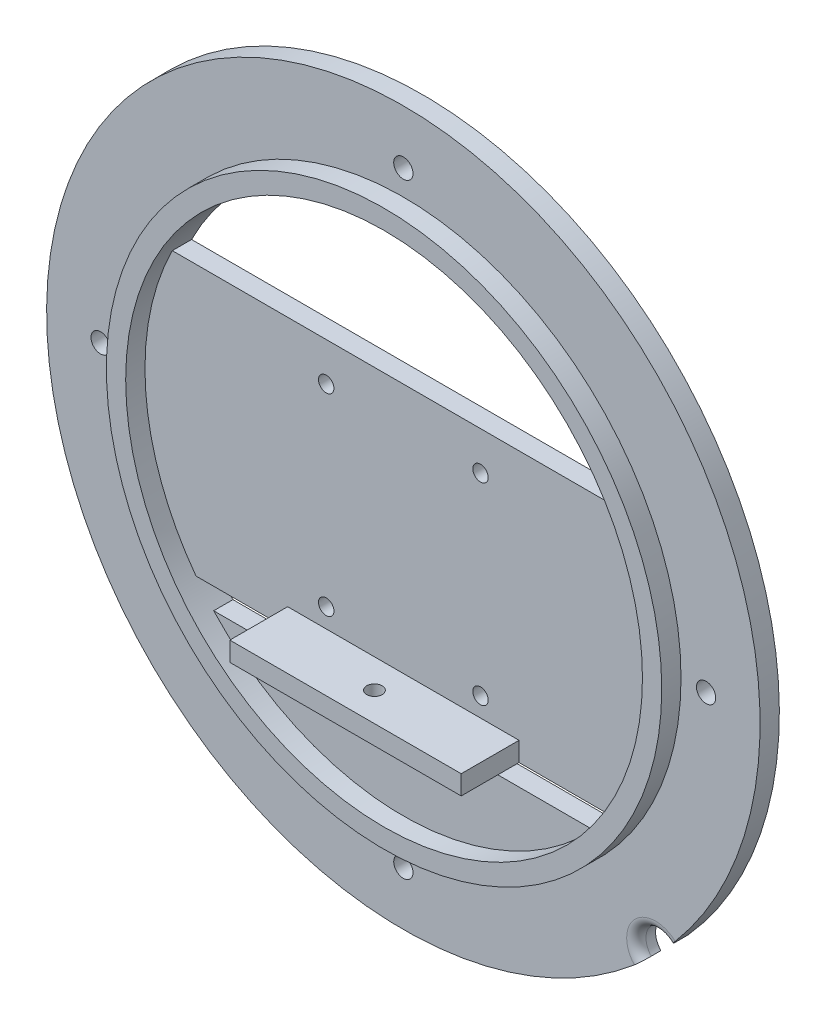
ISO-10303-21;
HEADER;
FILE_DESCRIPTION(('STEP AP214'),'2;1');
FILE_NAME('part.step','',(''),(''),'','','');
FILE_SCHEMA(('AUTOMOTIVE_DESIGN { 1 0 10303 214 1 1 1 1 }'));
ENDSEC;
DATA;
#1=APPLICATION_CONTEXT('core data for automotive mechanical design processes');
#2=APPLICATION_PROTOCOL_DEFINITION('international standard','automotive_design',2000,#1);
#3=PRODUCT_CONTEXT('',#1,'mechanical');
#4=PRODUCT('Part','Part','',(#3));
#5=PRODUCT_RELATED_PRODUCT_CATEGORY('part','',(#4));
#6=PRODUCT_DEFINITION_FORMATION('','',#4);
#7=PRODUCT_DEFINITION_CONTEXT('part definition',#1,'design');
#8=PRODUCT_DEFINITION('design','',#6,#7);
#9=PRODUCT_DEFINITION_SHAPE('','',#8);
#10=(LENGTH_UNIT() NAMED_UNIT(*) SI_UNIT(.MILLI.,.METRE.));
#11=(NAMED_UNIT(*) PLANE_ANGLE_UNIT() SI_UNIT($,.RADIAN.));
#12=(NAMED_UNIT(*) SI_UNIT($,.STERADIAN.) SOLID_ANGLE_UNIT());
#13=UNCERTAINTY_MEASURE_WITH_UNIT(LENGTH_MEASURE(1.E-05),#10,'distance_accuracy_value','');
#14=(GEOMETRIC_REPRESENTATION_CONTEXT(3) GLOBAL_UNCERTAINTY_ASSIGNED_CONTEXT((#13)) GLOBAL_UNIT_ASSIGNED_CONTEXT((#10,
#11,#12)) REPRESENTATION_CONTEXT('',''));
#15=CARTESIAN_POINT('',(0.,0.,0.));
#16=DIRECTION('',(0.,0.,1.));
#17=DIRECTION('',(1.,0.,0.));
#18=AXIS2_PLACEMENT_3D('',#15,#16,#17);
#19=CARTESIAN_POINT('',(0.,0.,5.));
#20=DIRECTION('',(0.,0.,1.));
#21=DIRECTION('',(1.,0.,0.));
#22=AXIS2_PLACEMENT_3D('',#19,#20,#21);
#23=PLANE('',#22);
#24=CARTESIAN_POINT('',(-20.,-30.,5.));
#25=DIRECTION('',(0.,0.,1.));
#26=DIRECTION('',(1.,0.,0.));
#27=AXIS2_PLACEMENT_3D('',#24,#25,#26);
#28=CIRCLE('',#27,2.);
#29=CARTESIAN_POINT('',(-18.,-30.,5.));
#30=VERTEX_POINT('',#29);
#31=EDGE_CURVE('E306',#30,#30,#28,.F.);
#32=ORIENTED_EDGE('',*,*,#31,.T.);
#33=EDGE_LOOP('',(#32));
#34=FACE_BOUND('',#33,.T.);
#35=CARTESIAN_POINT('',(-20.,20.,5.));
#36=DIRECTION('',(0.,0.,1.));
#37=DIRECTION('',(1.,0.,0.));
#38=AXIS2_PLACEMENT_3D('',#35,#36,#37);
#39=CIRCLE('',#38,2.00000000000001);
#40=CARTESIAN_POINT('',(-18.,20.,5.));
#41=VERTEX_POINT('',#40);
#42=EDGE_CURVE('E313',#41,#41,#39,.F.);
#43=ORIENTED_EDGE('',*,*,#42,.T.);
#44=EDGE_LOOP('',(#43));
#45=FACE_BOUND('',#44,.T.);
#46=CARTESIAN_POINT('',(20.,20.,5.));
#47=DIRECTION('',(0.,0.,1.));
#48=DIRECTION('',(1.,0.,0.));
#49=AXIS2_PLACEMENT_3D('',#46,#47,#48);
#50=CIRCLE('',#49,2.00000000000001);
#51=CARTESIAN_POINT('',(22.,20.,5.));
#52=VERTEX_POINT('',#51);
#53=EDGE_CURVE('E305',#52,#52,#50,.F.);
#54=ORIENTED_EDGE('',*,*,#53,.T.);
#55=EDGE_LOOP('',(#54));
#56=FACE_BOUND('',#55,.T.);
#57=CARTESIAN_POINT('',(20.,-30.,5.));
#58=DIRECTION('',(0.,0.,1.));
#59=DIRECTION('',(1.,0.,0.));
#60=AXIS2_PLACEMENT_3D('',#57,#58,#59);
#61=CIRCLE('',#60,2.);
#62=CARTESIAN_POINT('',(22.,-30.,5.));
#63=VERTEX_POINT('',#62);
#64=EDGE_CURVE('E298',#63,#63,#61,.F.);
#65=ORIENTED_EDGE('',*,*,#64,.T.);
#66=EDGE_LOOP('',(#65));
#67=FACE_BOUND('',#66,.T.);
#68=DIRECTION('',(-1.,0.,0.));
#69=VECTOR('',#68,1.);
#70=CARTESIAN_POINT('',(30.,-35.,5.));
#71=LINE('',#70,#69);
#72=CARTESIAN_POINT('',(30.,-35.,5.));
#73=VERTEX_POINT('',#72);
#74=CARTESIAN_POINT('',(-30.,-35.,5.));
#75=VERTEX_POINT('',#74);
#76=EDGE_CURVE('E360',#73,#75,#71,.T.);
#77=ORIENTED_EDGE('',*,*,#76,.F.);
#78=DIRECTION('',(0.,1.,0.));
#79=VECTOR('',#78,1.);
#80=CARTESIAN_POINT('',(30.,-40.,5.));
#81=LINE('',#80,#79);
#82=CARTESIAN_POINT('',(30.,-40.,5.));
#83=VERTEX_POINT('',#82);
#84=EDGE_CURVE('E362',#83,#73,#81,.T.);
#85=ORIENTED_EDGE('',*,*,#84,.F.);
#86=DIRECTION('',(-1.,0.,0.));
#87=VECTOR('',#86,1.);
#88=CARTESIAN_POINT('',(-70.,-40.,5.));
#89=LINE('',#88,#87);
#90=CARTESIAN_POINT('',(53.7494186015067,-40.,5.));
#91=VERTEX_POINT('',#90);
#92=EDGE_CURVE('E248',#91,#83,#89,.T.);
#93=ORIENTED_EDGE('',*,*,#92,.F.);
#94=CARTESIAN_POINT('',(0.,0.,5.));
#95=DIRECTION('',(0.,0.,1.));
#96=DIRECTION('',(1.,0.,0.));
#97=AXIS2_PLACEMENT_3D('',#94,#95,#96);
#98=CIRCLE('',#97,67.);
#99=CARTESIAN_POINT('',(59.9082632030007,30.,5.));
#100=VERTEX_POINT('',#99);
#101=EDGE_CURVE('E161',#100,#91,#98,.F.);
#102=ORIENTED_EDGE('',*,*,#101,.F.);
#103=DIRECTION('',(1.,0.,0.));
#104=VECTOR('',#103,1.);
#105=CARTESIAN_POINT('',(-70.,30.,5.));
#106=LINE('',#105,#104);
#107=CARTESIAN_POINT('',(-59.9082632030007,30.,5.));
#108=VERTEX_POINT('',#107);
#109=EDGE_CURVE('E289',#108,#100,#106,.T.);
#110=ORIENTED_EDGE('',*,*,#109,.F.);
#111=CARTESIAN_POINT('',(-53.7494186015068,-40.,5.));
#112=VERTEX_POINT('',#111);
#113=EDGE_CURVE('E164',#112,#108,#98,.F.);
#114=ORIENTED_EDGE('',*,*,#113,.F.);
#115=CARTESIAN_POINT('',(-30.,-40.,5.));
#116=VERTEX_POINT('',#115);
#117=EDGE_CURVE('E292',#116,#112,#89,.T.);
#118=ORIENTED_EDGE('',*,*,#117,.F.);
#119=DIRECTION('',(0.,-1.,0.));
#120=VECTOR('',#119,1.);
#121=CARTESIAN_POINT('',(-30.,-40.,5.));
#122=LINE('',#121,#120);
#123=EDGE_CURVE('E356',#75,#116,#122,.T.);
#124=ORIENTED_EDGE('',*,*,#123,.F.);
#125=EDGE_LOOP('',(#77,#85,#93,#102,#110,#114,#118,#124));
#126=FACE_BOUND('',#125,.T.);
#127=ADVANCED_FACE('F33',(#34,#45,#56,#67,#126),#23,.T.);
#128=CARTESIAN_POINT('',(0.,0.,5.));
#129=DIRECTION('',(0.,0.,-1.));
#130=DIRECTION('',(-1.,0.,0.));
#131=AXIS2_PLACEMENT_3D('',#128,#129,#130);
#132=CYLINDRICAL_SURFACE('',#131,92.5);
#133=DIRECTION('',(0.,0.,-1.));
#134=VECTOR('',#133,1.);
#135=CARTESIAN_POINT('',(61.7775799026703,-68.8460646759798,5.));
#136=LINE('',#135,#134);
#137=CARTESIAN_POINT('',(61.7775799026702,-68.8460646759798,0.));
#138=VERTEX_POINT('',#137);
#139=CARTESIAN_POINT('',(61.7775799026703,-68.8460646759798,2.5));
#140=VERTEX_POINT('',#139);
#141=EDGE_CURVE('E141',#138,#140,#136,.F.);
#142=ORIENTED_EDGE('',*,*,#141,.T.);
#143=CARTESIAN_POINT('',(61.7775799026703,-68.8460646759798,2.5));
#144=CARTESIAN_POINT('',(61.7775845242661,-68.8460597267927,2.57029488064408));
#145=CARTESIAN_POINT('',(61.7753724411692,-68.8480454745653,2.64058656436094));
#146=CARTESIAN_POINT('',(61.7665508133537,-68.8559602717512,2.7806669257484));
#147=CARTESIAN_POINT('',(61.7599414812899,-68.8618891304723,2.85045562757868));
#148=CARTESIAN_POINT('',(61.742367995557,-68.8776460578529,2.98898750084374));
#149=CARTESIAN_POINT('',(61.7314071644362,-68.8874711515706,3.05773142852272));
#150=CARTESIAN_POINT('',(61.7052139606343,-68.9109343734118,3.19371814053275));
#151=CARTESIAN_POINT('',(61.6899816398252,-68.9245724552311,3.26096094308244));
#152=CARTESIAN_POINT('',(61.6379899597252,-68.9710837400947,3.4597886614452));
#153=CARTESIAN_POINT('',(61.5949286722283,-69.0095604698082,3.58852951132559));
#154=CARTESIAN_POINT('',(61.4932139902941,-69.1002115822862,3.83439581930428));
#155=CARTESIAN_POINT('',(61.4345633188731,-69.1523835728636,3.95152330102239));
#156=CARTESIAN_POINT('',(61.3032110640128,-69.2688530186814,4.17097134556527));
#157=CARTESIAN_POINT('',(61.2305082888137,-69.3331515023592,4.27329065121979));
#158=CARTESIAN_POINT('',(61.0729995852603,-69.4719347217715,4.46020504846349));
#159=CARTESIAN_POINT('',(60.9881913111462,-69.5464214316264,4.54479669699202));
#160=CARTESIAN_POINT('',(60.8087578535947,-69.703365549009,4.69387705912722));
#161=CARTESIAN_POINT('',(60.7141280540339,-69.7858267032767,4.75835626232641));
#162=CARTESIAN_POINT('',(60.5176968893336,-69.9562379050795,4.86531109073812));
#163=CARTESIAN_POINT('',(60.4158996766867,-70.0441847711121,4.90779933932645));
#164=CARTESIAN_POINT('',(60.2434886355779,-70.192451575737,4.95907567043449));
#165=CARTESIAN_POINT('',(60.1740669611328,-70.2519753858825,4.97441352146144));
#166=CARTESIAN_POINT('',(60.0342829918745,-70.37146718808,4.99487438143663));
#167=CARTESIAN_POINT('',(59.963922176932,-70.4314344271017,5.00001190214171));
#168=CARTESIAN_POINT('',(59.8934375909475,-70.491319561626,5.));
#169=B_SPLINE_CURVE_WITH_KNOTS('',3,(#143,#144,#145,#146,#147,#148,#149,#150,#151,#152,#153,
#154,#155,#156,#157,#158,#159,#160,#161,#162,#163,#164,#165,#166,#167,#168),.UNSPECIFIED.,.F.,
.F.,(4,2,2,2,2,2,2,2,2,2,2,2,4),(0.,0.210816046447059,0.421621898388043,0.632267100015078,
0.84290974372171,1.26402485800765,1.68506646389841,2.10614379403164,2.52730283004982,
2.94866071524473,3.36977646113177,3.64741730174386,3.92466286577914),.UNSPECIFIED.);
#170=CARTESIAN_POINT('',(59.8934375909475,-70.491319561626,5.));
#171=VERTEX_POINT('',#170);
#172=EDGE_CURVE('E42',#140,#171,#169,.T.);
#173=ORIENTED_EDGE('',*,*,#172,.T.);
#174=CARTESIAN_POINT('',(0.,0.,5.));
#175=DIRECTION('',(0.,0.,1.));
#176=DIRECTION('',(1.,0.,0.));
#177=AXIS2_PLACEMENT_3D('',#174,#175,#176);
#178=CIRCLE('',#177,92.5);
#179=CARTESIAN_POINT('',(70.4913195616258,-59.8934375909478,5.));
#180=VERTEX_POINT('',#179);
#181=EDGE_CURVE('E151',#180,#171,#178,.T.);
#182=ORIENTED_EDGE('',*,*,#181,.F.);
#183=CARTESIAN_POINT('',(70.4913195616258,-59.8934375909478,5.));
#184=CARTESIAN_POINT('',(70.4457543716357,-59.9470665464307,5.00000670749383));
#185=CARTESIAN_POINT('',(70.400128821235,-60.0006401326924,4.99703355472791));
#186=CARTESIAN_POINT('',(70.3090829769912,-60.1073017992439,4.98517857708269));
#187=CARTESIAN_POINT('',(70.2636626740515,-60.1603899011593,4.97629701670199));
#188=CARTESIAN_POINT('',(70.1733822765144,-60.2656720855444,4.95268492382602));
#189=CARTESIAN_POINT('',(70.128521795559,-60.3178667950202,4.93795868493333));
#190=CARTESIAN_POINT('',(70.0396668376696,-60.4210204587536,4.90277554609998));
#191=CARTESIAN_POINT('',(69.9956723494296,-60.4719794291465,4.88231872102904));
#192=CARTESIAN_POINT('',(69.8654228761967,-60.6225223628849,4.81251506128992));
#193=CARTESIAN_POINT('',(69.7808665966486,-60.7198134720848,4.75472576944307));
#194=CARTESIAN_POINT('',(69.6190268791652,-60.9053060510883,4.61836033755434));
#195=CARTESIAN_POINT('',(69.5417421001973,-60.9935091972086,4.53978804060566));
#196=CARTESIAN_POINT('',(69.3967107959473,-61.1584711666837,4.3640942082479));
#197=CARTESIAN_POINT('',(69.3289600788465,-61.2352350204063,4.26698086927598));
#198=CARTESIAN_POINT('',(69.2050094321238,-61.3752836619158,4.05691691069355));
#199=CARTESIAN_POINT('',(69.1488117657103,-61.4385658087643,3.94396319527664));
#200=CARTESIAN_POINT('',(69.0497090266176,-61.5499249161967,3.70548322867484));
#201=CARTESIAN_POINT('',(69.0068009078782,-61.5980053611732,3.57995986728514));
#202=CARTESIAN_POINT('',(68.9355962169093,-61.6776819245926,3.31989899014615));
#203=CARTESIAN_POINT('',(68.9072910371697,-61.7092877538949,3.18536683747078));
#204=CARTESIAN_POINT('',(68.8732124958008,-61.7473157970358,2.95834073521043));
#205=CARTESIAN_POINT('',(68.8630394681523,-61.7586590906191,2.86727679849403));
#206=CARTESIAN_POINT('',(68.8494658480072,-61.7737896028643,2.68415465343161));
#207=CARTESIAN_POINT('',(68.8460556593617,-61.7775875280613,2.59209804053621));
#208=CARTESIAN_POINT('',(68.8460646759795,-61.7775799026706,2.5));
#209=B_SPLINE_CURVE_WITH_KNOTS('',3,(#183,#184,#185,#186,#187,#188,#189,#190,#191,#192,#193,
#194,#195,#196,#197,#198,#199,#200,#201,#202,#203,#204,#205,#206,#207,#208),.UNSPECIFIED.,.F.,
.F.,(4,2,2,2,2,2,2,2,2,2,2,2,4),(0.,0.211048232120254,0.422087016989965,0.632971055203021,
0.84385233835941,1.26545205870932,1.68697387330465,2.10830977544879,2.52972813755899,
2.95104983593201,3.37212290722352,3.6485876014088,3.92465972376364),.UNSPECIFIED.);
#210=CARTESIAN_POINT('',(68.8460646759795,-61.7775799026706,2.5));
#211=VERTEX_POINT('',#210);
#212=EDGE_CURVE('E137',#180,#211,#209,.T.);
#213=ORIENTED_EDGE('',*,*,#212,.T.);
#214=DIRECTION('',(0.,0.,-1.));
#215=VECTOR('',#214,1.);
#216=CARTESIAN_POINT('',(68.8460646759795,-61.7775799026706,5.));
#217=LINE('',#216,#215);
#218=CARTESIAN_POINT('',(68.8460646759795,-61.7775799026706,0.));
#219=VERTEX_POINT('',#218);
#220=EDGE_CURVE('E131',#211,#219,#217,.T.);
#221=ORIENTED_EDGE('',*,*,#220,.T.);
#222=CARTESIAN_POINT('',(0.,0.,0.));
#223=DIRECTION('',(0.,0.,1.));
#224=DIRECTION('',(1.,0.,0.));
#225=AXIS2_PLACEMENT_3D('',#222,#223,#224);
#226=CIRCLE('',#225,92.5);
#227=EDGE_CURVE('E135',#219,#138,#226,.T.);
#228=ORIENTED_EDGE('',*,*,#227,.T.);
#229=EDGE_LOOP('',(#142,#173,#182,#213,#221,#228));
#230=FACE_BOUND('',#229,.T.);
#231=ADVANCED_FACE('F133',(#230),#132,.T.);
#232=CARTESIAN_POINT('',(0.,0.,5.));
#233=DIRECTION('',(0.,0.,1.));
#234=DIRECTION('',(1.,0.,0.));
#235=AXIS2_PLACEMENT_3D('',#232,#233,#234);
#236=PLANE('',#235);
#237=ORIENTED_EDGE('',*,*,#181,.T.);
#238=CARTESIAN_POINT('',(65.4073772597555,-65.4073772597558,5.));
#239=DIRECTION('',(0.,0.,1.));
#240=DIRECTION('',(1.,0.,0.));
#241=AXIS2_PLACEMENT_3D('',#238,#239,#240);
#242=CIRCLE('',#241,7.5);
#243=EDGE_CURVE('E11',#171,#180,#242,.F.);
#244=ORIENTED_EDGE('',*,*,#243,.T.);
#245=EDGE_LOOP('',(#237,#244));
#246=FACE_BOUND('',#245,.T.);
#247=CARTESIAN_POINT('',(0.,-78.5,5.));
#248=DIRECTION('',(0.,0.,1.));
#249=DIRECTION('',(1.,0.,0.));
#250=AXIS2_PLACEMENT_3D('',#247,#248,#249);
#251=CIRCLE('',#250,2.5);
#252=CARTESIAN_POINT('',(2.5,-78.5,5.));
#253=VERTEX_POINT('',#252);
#254=EDGE_CURVE('E312',#253,#253,#251,.F.);
#255=ORIENTED_EDGE('',*,*,#254,.T.);
#256=EDGE_LOOP('',(#255));
#257=FACE_BOUND('',#256,.T.);
#258=CARTESIAN_POINT('',(78.5,0.,5.));
#259=DIRECTION('',(0.,0.,1.));
#260=DIRECTION('',(1.,0.,0.));
#261=AXIS2_PLACEMENT_3D('',#258,#259,#260);
#262=CIRCLE('',#261,2.50000000000001);
#263=CARTESIAN_POINT('',(81.,0.,5.));
#264=VERTEX_POINT('',#263);
#265=EDGE_CURVE('E337',#264,#264,#262,.F.);
#266=ORIENTED_EDGE('',*,*,#265,.T.);
#267=EDGE_LOOP('',(#266));
#268=FACE_BOUND('',#267,.T.);
#269=CARTESIAN_POINT('',(0.,78.5,5.));
#270=DIRECTION('',(0.,0.,1.));
#271=DIRECTION('',(1.,0.,0.));
#272=AXIS2_PLACEMENT_3D('',#269,#270,#271);
#273=CIRCLE('',#272,2.5);
#274=CARTESIAN_POINT('',(2.5,78.5,5.));
#275=VERTEX_POINT('',#274);
#276=EDGE_CURVE('E331',#275,#275,#273,.F.);
#277=ORIENTED_EDGE('',*,*,#276,.T.);
#278=EDGE_LOOP('',(#277));
#279=FACE_BOUND('',#278,.T.);
#280=CARTESIAN_POINT('',(-78.5,0.,5.));
#281=DIRECTION('',(0.,0.,1.));
#282=DIRECTION('',(1.,0.,0.));
#283=AXIS2_PLACEMENT_3D('',#280,#281,#282);
#284=CIRCLE('',#283,2.49999999999999);
#285=CARTESIAN_POINT('',(-76.,0.,5.));
#286=VERTEX_POINT('',#285);
#287=EDGE_CURVE('E323',#286,#286,#284,.F.);
#288=ORIENTED_EDGE('',*,*,#287,.T.);
#289=EDGE_LOOP('',(#288));
#290=FACE_BOUND('',#289,.T.);
#291=CARTESIAN_POINT('',(0.,0.,5.));
#292=DIRECTION('',(0.,0.,1.));
#293=DIRECTION('',(1.,0.,0.));
#294=AXIS2_PLACEMENT_3D('',#291,#292,#293);
#295=CIRCLE('',#294,72.);
#296=CARTESIAN_POINT('',(72.,0.,5.));
#297=VERTEX_POINT('',#296);
#298=EDGE_CURVE('E154',#297,#297,#295,.T.);
#299=ORIENTED_EDGE('',*,*,#298,.F.);
#300=EDGE_LOOP('',(#299));
#301=FACE_BOUND('',#300,.T.);
#302=ADVANCED_FACE('F208',(#246,#257,#268,#279,#290,#301),#236,.T.);
#303=CARTESIAN_POINT('',(0.,0.,0.));
#304=DIRECTION('',(0.,0.,1.));
#305=DIRECTION('',(1.,0.,0.));
#306=AXIS2_PLACEMENT_3D('',#303,#304,#305);
#307=PLANE('',#306);
#308=CARTESIAN_POINT('',(0.,-78.5,0.));
#309=DIRECTION('',(0.,0.,-1.));
#310=DIRECTION('',(-1.,0.,0.));
#311=AXIS2_PLACEMENT_3D('',#308,#309,#310);
#312=CIRCLE('',#311,2.5);
#313=CARTESIAN_POINT('',(-2.5,-78.5,0.));
#314=VERTEX_POINT('',#313);
#315=EDGE_CURVE('E340',#314,#314,#312,.T.);
#316=ORIENTED_EDGE('',*,*,#315,.F.);
#317=EDGE_LOOP('',(#316));
#318=FACE_BOUND('',#317,.T.);
#319=CARTESIAN_POINT('',(78.5,0.,0.));
#320=DIRECTION('',(0.,0.,-1.));
#321=DIRECTION('',(-1.,0.,0.));
#322=AXIS2_PLACEMENT_3D('',#319,#320,#321);
#323=CIRCLE('',#322,2.50000000000001);
#324=CARTESIAN_POINT('',(76.,0.,0.));
#325=VERTEX_POINT('',#324);
#326=EDGE_CURVE('E334',#325,#325,#323,.T.);
#327=ORIENTED_EDGE('',*,*,#326,.F.);
#328=EDGE_LOOP('',(#327));
#329=FACE_BOUND('',#328,.T.);
#330=CARTESIAN_POINT('',(0.,78.5,0.));
#331=DIRECTION('',(0.,0.,-1.));
#332=DIRECTION('',(-1.,0.,0.));
#333=AXIS2_PLACEMENT_3D('',#330,#331,#332);
#334=CIRCLE('',#333,2.5);
#335=CARTESIAN_POINT('',(-2.5,78.5,0.));
#336=VERTEX_POINT('',#335);
#337=EDGE_CURVE('E326',#336,#336,#334,.T.);
#338=ORIENTED_EDGE('',*,*,#337,.F.);
#339=EDGE_LOOP('',(#338));
#340=FACE_BOUND('',#339,.T.);
#341=CARTESIAN_POINT('',(-78.5,0.,0.));
#342=DIRECTION('',(0.,0.,-1.));
#343=DIRECTION('',(-1.,0.,0.));
#344=AXIS2_PLACEMENT_3D('',#341,#342,#343);
#345=CIRCLE('',#344,2.49999999999999);
#346=CARTESIAN_POINT('',(-81.,0.,0.));
#347=VERTEX_POINT('',#346);
#348=EDGE_CURVE('E327',#347,#347,#345,.T.);
#349=ORIENTED_EDGE('',*,*,#348,.F.);
#350=EDGE_LOOP('',(#349));
#351=FACE_BOUND('',#350,.T.);
#352=CARTESIAN_POINT('',(-20.,-30.,0.));
#353=DIRECTION('',(0.,0.,-1.));
#354=DIRECTION('',(-1.,0.,0.));
#355=AXIS2_PLACEMENT_3D('',#352,#353,#354);
#356=CIRCLE('',#355,2.);
#357=CARTESIAN_POINT('',(-22.,-30.,0.));
#358=VERTEX_POINT('',#357);
#359=EDGE_CURVE('E309',#358,#358,#356,.T.);
#360=ORIENTED_EDGE('',*,*,#359,.F.);
#361=EDGE_LOOP('',(#360));
#362=FACE_BOUND('',#361,.T.);
#363=CARTESIAN_POINT('',(-20.,20.,0.));
#364=DIRECTION('',(0.,0.,-1.));
#365=DIRECTION('',(-1.,0.,0.));
#366=AXIS2_PLACEMENT_3D('',#363,#364,#365);
#367=CIRCLE('',#366,2.00000000000001);
#368=CARTESIAN_POINT('',(-22.,20.,0.));
#369=VERTEX_POINT('',#368);
#370=EDGE_CURVE('E308',#369,#369,#367,.T.);
#371=ORIENTED_EDGE('',*,*,#370,.F.);
#372=EDGE_LOOP('',(#371));
#373=FACE_BOUND('',#372,.T.);
#374=CARTESIAN_POINT('',(20.,20.,0.));
#375=DIRECTION('',(0.,0.,-1.));
#376=DIRECTION('',(-1.,0.,0.));
#377=AXIS2_PLACEMENT_3D('',#374,#375,#376);
#378=CIRCLE('',#377,2.00000000000001);
#379=CARTESIAN_POINT('',(18.,20.,0.));
#380=VERTEX_POINT('',#379);
#381=EDGE_CURVE('E316',#380,#380,#378,.T.);
#382=ORIENTED_EDGE('',*,*,#381,.F.);
#383=EDGE_LOOP('',(#382));
#384=FACE_BOUND('',#383,.T.);
#385=CARTESIAN_POINT('',(20.,-30.,0.));
#386=DIRECTION('',(0.,0.,-1.));
#387=DIRECTION('',(-1.,0.,0.));
#388=AXIS2_PLACEMENT_3D('',#385,#386,#387);
#389=CIRCLE('',#388,2.);
#390=CARTESIAN_POINT('',(18.,-30.,0.));
#391=VERTEX_POINT('',#390);
#392=EDGE_CURVE('E302',#391,#391,#389,.T.);
#393=ORIENTED_EDGE('',*,*,#392,.F.);
#394=EDGE_LOOP('',(#393));
#395=FACE_BOUND('',#394,.T.);
#396=DIRECTION('',(1.,0.,0.));
#397=VECTOR('',#396,1.);
#398=CARTESIAN_POINT('',(55.,-45.5,0.));
#399=LINE('',#398,#397);
#400=CARTESIAN_POINT('',(-49.180788932265,-45.5,0.));
#401=VERTEX_POINT('',#400);
#402=CARTESIAN_POINT('',(49.180788932265,-45.5,0.));
#403=VERTEX_POINT('',#402);
#404=EDGE_CURVE('E245',#401,#403,#399,.T.);
#405=ORIENTED_EDGE('',*,*,#404,.T.);
#406=CARTESIAN_POINT('',(0.,0.,0.));
#407=DIRECTION('',(0.,0.,-1.));
#408=DIRECTION('',(-1.,0.,0.));
#409=AXIS2_PLACEMENT_3D('',#406,#407,#408);
#410=CIRCLE('',#409,67.);
#411=CARTESIAN_POINT('',(55.52251795443,-37.5,0.));
#412=VERTEX_POINT('',#411);
#413=EDGE_CURVE('E235',#412,#403,#410,.T.);
#414=ORIENTED_EDGE('',*,*,#413,.F.);
#415=DIRECTION('',(-1.,0.,0.));
#416=VECTOR('',#415,1.);
#417=CARTESIAN_POINT('',(-53.7494186015068,-37.5,0.));
#418=LINE('',#417,#416);
#419=CARTESIAN_POINT('',(-55.52251795443,-37.5,0.));
#420=VERTEX_POINT('',#419);
#421=EDGE_CURVE('E175',#412,#420,#418,.T.);
#422=ORIENTED_EDGE('',*,*,#421,.T.);
#423=EDGE_CURVE('E243',#401,#420,#410,.T.);
#424=ORIENTED_EDGE('',*,*,#423,.F.);
#425=EDGE_LOOP('',(#405,#414,#422,#424));
#426=FACE_BOUND('',#425,.T.);
#427=DIRECTION('',(1.,0.,0.));
#428=VECTOR('',#427,1.);
#429=CARTESIAN_POINT('',(-70.,30.,0.));
#430=LINE('',#429,#428);
#431=CARTESIAN_POINT('',(-59.9082632030007,30.,0.));
#432=VERTEX_POINT('',#431);
#433=CARTESIAN_POINT('',(59.9082632030007,30.,0.));
#434=VERTEX_POINT('',#433);
#435=EDGE_CURVE('E287',#432,#434,#430,.T.);
#436=ORIENTED_EDGE('',*,*,#435,.T.);
#437=EDGE_CURVE('E246',#432,#434,#410,.T.);
#438=ORIENTED_EDGE('',*,*,#437,.F.);
#439=EDGE_LOOP('',(#436,#438));
#440=FACE_BOUND('',#439,.T.);
#441=ORIENTED_EDGE('',*,*,#227,.F.);
#442=CARTESIAN_POINT('',(65.4073772597555,-65.4073772597558,0.));
#443=DIRECTION('',(0.,0.,1.));
#444=DIRECTION('',(1.,0.,0.));
#445=AXIS2_PLACEMENT_3D('',#442,#443,#444);
#446=CIRCLE('',#445,5.);
#447=EDGE_CURVE('E144',#219,#138,#446,.T.);
#448=ORIENTED_EDGE('',*,*,#447,.T.);
#449=EDGE_LOOP('',(#441,#448));
#450=FACE_BOUND('',#449,.T.);
#451=ADVANCED_FACE('F150',(#318,#329,#340,#351,#362,#373,#384,#395,#426,#440,#450),#307,.F.);
#452=CARTESIAN_POINT('',(0.,0.,10.));
#453=DIRECTION('',(0.,0.,-1.));
#454=DIRECTION('',(-1.,0.,0.));
#455=AXIS2_PLACEMENT_3D('',#452,#453,#454);
#456=CYLINDRICAL_SURFACE('',#455,72.);
#457=CARTESIAN_POINT('',(0.,0.,10.));
#458=DIRECTION('',(0.,0.,1.));
#459=DIRECTION('',(1.,0.,0.));
#460=AXIS2_PLACEMENT_3D('',#457,#458,#459);
#461=CIRCLE('',#460,72.);
#462=CARTESIAN_POINT('',(72.,0.,10.));
#463=VERTEX_POINT('',#462);
#464=EDGE_CURVE('E152',#463,#463,#461,.T.);
#465=ORIENTED_EDGE('',*,*,#464,.F.);
#466=EDGE_LOOP('',(#465));
#467=FACE_BOUND('',#466,.T.);
#468=ORIENTED_EDGE('',*,*,#298,.T.);
#469=EDGE_LOOP('',(#468));
#470=FACE_BOUND('',#469,.T.);
#471=ADVANCED_FACE('F254',(#467,#470),#456,.T.);
#472=CARTESIAN_POINT('',(0.,0.,10.));
#473=DIRECTION('',(0.,0.,1.));
#474=DIRECTION('',(1.,0.,0.));
#475=AXIS2_PLACEMENT_3D('',#472,#473,#474);
#476=PLANE('',#475);
#477=CARTESIAN_POINT('',(0.,0.,10.));
#478=DIRECTION('',(0.,0.,-1.));
#479=DIRECTION('',(-1.,0.,0.));
#480=AXIS2_PLACEMENT_3D('',#477,#478,#479);
#481=CIRCLE('',#480,67.);
#482=CARTESIAN_POINT('',(-67.,0.,10.));
#483=VERTEX_POINT('',#482);
#484=EDGE_CURVE('E157',#483,#483,#481,.T.);
#485=ORIENTED_EDGE('',*,*,#484,.T.);
#486=EDGE_LOOP('',(#485));
#487=FACE_BOUND('',#486,.T.);
#488=ORIENTED_EDGE('',*,*,#464,.T.);
#489=EDGE_LOOP('',(#488));
#490=FACE_BOUND('',#489,.T.);
#491=ADVANCED_FACE('F474',(#487,#490),#476,.T.);
#492=CARTESIAN_POINT('',(0.,0.,10.));
#493=DIRECTION('',(0.,0.,-1.));
#494=DIRECTION('',(-1.,0.,0.));
#495=AXIS2_PLACEMENT_3D('',#492,#493,#494);
#496=CYLINDRICAL_SURFACE('',#495,67.);
#497=ORIENTED_EDGE('',*,*,#413,.T.);
#498=DIRECTION('',(0.,0.,-1.));
#499=VECTOR('',#498,1.);
#500=CARTESIAN_POINT('',(49.180788932265,-45.5,10.));
#501=LINE('',#500,#499);
#502=CARTESIAN_POINT('',(49.180788932265,-45.5,5.));
#503=VERTEX_POINT('',#502);
#504=EDGE_CURVE('E148',#403,#503,#501,.F.);
#505=ORIENTED_EDGE('',*,*,#504,.T.);
#506=CARTESIAN_POINT('',(0.,0.,5.));
#507=DIRECTION('',(0.,0.,-1.));
#508=DIRECTION('',(-1.,0.,0.));
#509=AXIS2_PLACEMENT_3D('',#506,#507,#508);
#510=CIRCLE('',#509,67.);
#511=CARTESIAN_POINT('',(-49.180788932265,-45.5,5.));
#512=VERTEX_POINT('',#511);
#513=EDGE_CURVE('E225',#512,#503,#510,.F.);
#514=ORIENTED_EDGE('',*,*,#513,.F.);
#515=DIRECTION('',(0.,0.,-1.));
#516=VECTOR('',#515,1.);
#517=CARTESIAN_POINT('',(-49.180788932265,-45.5,10.));
#518=LINE('',#517,#516);
#519=EDGE_CURVE('E223',#512,#401,#518,.T.);
#520=ORIENTED_EDGE('',*,*,#519,.T.);
#521=ORIENTED_EDGE('',*,*,#423,.T.);
#522=CARTESIAN_POINT('',(-55.52251795443,-37.5,0.));
#523=CARTESIAN_POINT('',(-55.4632440830582,-37.58776320925,1.588865583409E-05));
#524=CARTESIAN_POINT('',(-55.4037949976396,-37.6753318881441,0.00462328313600626));
#525=CARTESIAN_POINT('',(-55.2849136580255,-37.8495631871308,0.0230045283893117));
#526=CARTESIAN_POINT('',(-55.2254814194392,-37.9362254404987,0.0367819537786903));
#527=CARTESIAN_POINT('',(-55.046934102485,-38.1952750780284,0.0921170171802291));
#528=CARTESIAN_POINT('',(-54.9284785371727,-38.3653785083892,0.147677694833614));
#529=CARTESIAN_POINT('',(-54.7032524907535,-38.6857968416439,0.292416472417243));
#530=CARTESIAN_POINT('',(-54.5961953250302,-38.836661167315,0.379939047007094));
#531=CARTESIAN_POINT('',(-54.3928966144718,-39.120877531332,0.588564159533133));
#532=CARTESIAN_POINT('',(-54.2966099752949,-39.2543030116989,0.709518717677333));
#533=CARTESIAN_POINT('',(-54.1489938820084,-39.4575332552187,0.940009284231443));
#534=CARTESIAN_POINT('',(-54.0931390834981,-39.5340323071798,1.04080871983558));
#535=CARTESIAN_POINT('',(-53.9915237891939,-39.6726950065866,1.25670255587298));
#536=CARTESIAN_POINT('',(-53.945763710393,-39.7348580618454,1.37179754652063));
#537=CARTESIAN_POINT('',(-53.8865916762624,-39.8150268539274,1.55388687777492));
#538=CARTESIAN_POINT('',(-53.868377872019,-39.8396614985135,1.61649950453075));
#539=CARTESIAN_POINT('',(-53.8355445416251,-39.884018150131,1.74433894499644));
#540=CARTESIAN_POINT('',(-53.820922982202,-39.9037429363109,1.80956425545199));
#541=CARTESIAN_POINT('',(-53.7955927243815,-39.9378849727522,1.94198102060025));
#542=CARTESIAN_POINT('',(-53.7848760407399,-39.9523130549253,2.00916815590287));
#543=CARTESIAN_POINT('',(-53.7675543069141,-39.9756215256442,2.14498269715764));
#544=CARTESIAN_POINT('',(-53.7609459955989,-39.9845063143483,2.21360891594969));
#545=CARTESIAN_POINT('',(-53.7541193844086,-39.9936827884614,2.31871838562667));
#546=CARTESIAN_POINT('',(-53.7523566780077,-39.9960517736335,2.35493673306331));
#547=CARTESIAN_POINT('',(-53.7500067049264,-39.9992097558051,2.4274345606377));
#548=CARTESIAN_POINT('',(-53.749417963693,-40.0000007348516,2.46371390672953));
#549=CARTESIAN_POINT('',(-53.7494186015068,-40.,2.5));
#550=B_SPLINE_CURVE_WITH_KNOTS('',3,(#522,#523,#524,#525,#526,#527,#528,#529,#530,#531,#532,
#533,#534,#535,#536,#537,#538,#539,#540,#541,#542,#543,#544,#545,#546,#547,#548,#549),
.UNSPECIFIED.,.F.,.F.,(4,2,2,2,2,2,2,2,2,2,2,2,2,4),(0.,0.317488136792001,0.635100107785104,
1.27513520139012,1.8858682446488,2.49394013888756,2.90738515469495,3.32084724590526,
3.52970599118443,3.73844624502665,3.94675720920705,4.15490260912474,4.26387116804923,
4.37270277114536),.UNSPECIFIED.);
#551=CARTESIAN_POINT('',(-53.7494186015068,-40.,2.5));
#552=VERTEX_POINT('',#551);
#553=EDGE_CURVE('E180',#420,#552,#550,.T.);
#554=ORIENTED_EDGE('',*,*,#553,.T.);
#555=DIRECTION('',(0.,0.,-1.));
#556=VECTOR('',#555,1.);
#557=CARTESIAN_POINT('',(-53.7494186015068,-40.,10.));
#558=LINE('',#557,#556);
#559=EDGE_CURVE('E172',#552,#112,#558,.F.);
#560=ORIENTED_EDGE('',*,*,#559,.T.);
#561=ORIENTED_EDGE('',*,*,#113,.T.);
#562=DIRECTION('',(0.,0.,-1.));
#563=VECTOR('',#562,1.);
#564=CARTESIAN_POINT('',(-59.9082632030007,30.,10.));
#565=LINE('',#564,#563);
#566=EDGE_CURVE('E169',#108,#432,#565,.T.);
#567=ORIENTED_EDGE('',*,*,#566,.T.);
#568=ORIENTED_EDGE('',*,*,#437,.T.);
#569=DIRECTION('',(0.,0.,-1.));
#570=VECTOR('',#569,1.);
#571=CARTESIAN_POINT('',(59.9082632030007,30.,10.));
#572=LINE('',#571,#570);
#573=EDGE_CURVE('E163',#434,#100,#572,.F.);
#574=ORIENTED_EDGE('',*,*,#573,.T.);
#575=ORIENTED_EDGE('',*,*,#101,.T.);
#576=DIRECTION('',(0.,0.,-1.));
#577=VECTOR('',#576,1.);
#578=CARTESIAN_POINT('',(53.7494186015067,-40.,10.));
#579=LINE('',#578,#577);
#580=CARTESIAN_POINT('',(53.7494186015067,-40.,2.5));
#581=VERTEX_POINT('',#580);
#582=EDGE_CURVE('E166',#91,#581,#579,.T.);
#583=ORIENTED_EDGE('',*,*,#582,.T.);
#584=CARTESIAN_POINT('',(53.7494186015067,-40.,2.5));
#585=CARTESIAN_POINT('',(53.7494085114287,-40.0000123908809,2.43930959965619));
#586=CARTESIAN_POINT('',(53.7510629600194,-39.9977903909757,2.37862744942735));
#587=CARTESIAN_POINT('',(53.7576237294607,-39.9889728034297,2.25778918899682));
#588=CARTESIAN_POINT('',(53.762528370558,-39.982379474963,2.19763282332367));
#589=CARTESIAN_POINT('',(53.7754736405455,-39.9649664693916,2.07864886097415));
#590=CARTESIAN_POINT('',(53.7834953392095,-39.954172303825,2.01981546916449));
#591=CARTESIAN_POINT('',(53.8025300025628,-39.9285364081723,1.90354362752521));
#592=CARTESIAN_POINT('',(53.8135432126914,-39.913694345975,1.84610529257481));
#593=CARTESIAN_POINT('',(53.8507770190097,-39.8634614902711,1.6766690494055));
#594=CARTESIAN_POINT('',(53.8812276549487,-39.8223159837194,1.56723154797739));
#595=CARTESIAN_POINT('',(53.9517399480183,-39.7267323945261,1.35763978467214));
#596=CARTESIAN_POINT('',(53.9918147643792,-39.6722761101049,1.25749849581147));
#597=CARTESIAN_POINT('',(54.0830591523657,-39.5478075543817,1.06090463101593));
#598=CARTESIAN_POINT('',(54.1348307662797,-39.4769416456489,0.965275116577705));
#599=CARTESIAN_POINT('',(54.2453732440932,-39.3249071822827,0.787272728104595));
#600=CARTESIAN_POINT('',(54.304145682763,-39.2437363093727,0.704902846535596));
#601=CARTESIAN_POINT('',(54.4386421079447,-39.0570075463906,0.539360695898549));
#602=CARTESIAN_POINT('',(54.5154659174583,-38.9497455350817,0.459005475765163));
#603=CARTESIAN_POINT('',(54.6742375914399,-38.7265613270561,0.317562077150722));
#604=CARTESIAN_POINT('',(54.7561914205947,-38.610629017688,0.256496845153551));
#605=CARTESIAN_POINT('',(54.9386074182777,-38.3507366819709,0.144197336630406));
#606=CARTESIAN_POINT('',(55.03970110147,-38.2055437949092,0.0968376912570801));
#607=CARTESIAN_POINT('',(55.2434429881226,-37.910342391821,0.0292728829770364));
#608=CARTESIAN_POINT('',(55.3460883441206,-37.7603422372724,0.0090229400905055));
#609=CARTESIAN_POINT('',(55.4730660388496,-37.5731412380005,0.000802618745671298));
#610=CARTESIAN_POINT('',(55.4978142386588,-37.5365773624677,-1.45496067119308E-07));
#611=CARTESIAN_POINT('',(55.52251795443,-37.5,0.));
#612=B_SPLINE_CURVE_WITH_KNOTS('',3,(#584,#585,#586,#587,#588,#589,#590,#591,#592,#593,#594,
#595,#596,#597,#598,#599,#600,#601,#602,#603,#604,#605,#606,#607,#608,#609,#610,#611),
.UNSPECIFIED.,.F.,.F.,(4,2,2,2,2,2,2,2,2,2,2,2,2,4),(0.,0.181994419737893,0.363894855029514,
0.544707433052058,0.725534850370069,1.08623042832009,1.44742202504253,1.83537540596981,
2.22341621877373,2.68513323558594,3.14739743933252,3.69469408200092,4.24108557653509,
4.37353100076493),.UNSPECIFIED.);
#613=EDGE_CURVE('E187',#581,#412,#612,.T.);
#614=ORIENTED_EDGE('',*,*,#613,.T.);
#615=EDGE_LOOP('',(#497,#505,#514,#520,#521,#554,#560,#561,#567,#568,#574,#575,#583,#614));
#616=FACE_BOUND('',#615,.T.);
#617=ORIENTED_EDGE('',*,*,#484,.F.);
#618=EDGE_LOOP('',(#617));
#619=FACE_BOUND('',#618,.T.);
#620=ADVANCED_FACE('F193',(#616,#619),#496,.F.);
#621=CARTESIAN_POINT('',(-70.,-40.,5.));
#622=DIRECTION('',(0.,-1.,0.));
#623=DIRECTION('',(1.,0.,0.));
#624=AXIS2_PLACEMENT_3D('',#621,#622,#623);
#625=PLANE('',#624);
#626=CARTESIAN_POINT('',(0.,-40.,12.5));
#627=DIRECTION('',(0.,-1.,0.));
#628=DIRECTION('',(1.,0.,0.));
#629=AXIS2_PLACEMENT_3D('',#626,#627,#628);
#630=CIRCLE('',#629,2.);
#631=CARTESIAN_POINT('',(2.,-40.,12.5));
#632=VERTEX_POINT('',#631);
#633=EDGE_CURVE('E375',#632,#632,#630,.T.);
#634=ORIENTED_EDGE('',*,*,#633,.F.);
#635=EDGE_LOOP('',(#634));
#636=FACE_BOUND('',#635,.T.);
#637=ORIENTED_EDGE('',*,*,#559,.F.);
#638=DIRECTION('',(-1.,0.,0.));
#639=VECTOR('',#638,1.);
#640=CARTESIAN_POINT('',(53.7494186015067,-40.,2.5));
#641=LINE('',#640,#639);
#642=EDGE_CURVE('E178',#552,#581,#641,.F.);
#643=ORIENTED_EDGE('',*,*,#642,.T.);
#644=ORIENTED_EDGE('',*,*,#582,.F.);
#645=ORIENTED_EDGE('',*,*,#92,.T.);
#646=DIRECTION('',(0.,0.,-1.));
#647=VECTOR('',#646,1.);
#648=CARTESIAN_POINT('',(30.,-40.,20.));
#649=LINE('',#648,#647);
#650=CARTESIAN_POINT('',(30.,-40.,20.));
#651=VERTEX_POINT('',#650);
#652=EDGE_CURVE('E353',#651,#83,#649,.T.);
#653=ORIENTED_EDGE('',*,*,#652,.F.);
#654=DIRECTION('',(1.,0.,0.));
#655=VECTOR('',#654,1.);
#656=CARTESIAN_POINT('',(30.,-40.,20.));
#657=LINE('',#656,#655);
#658=CARTESIAN_POINT('',(-30.,-40.,20.));
#659=VERTEX_POINT('',#658);
#660=EDGE_CURVE('E355',#659,#651,#657,.T.);
#661=ORIENTED_EDGE('',*,*,#660,.F.);
#662=DIRECTION('',(0.,0.,-1.));
#663=VECTOR('',#662,1.);
#664=CARTESIAN_POINT('',(-30.,-40.,20.));
#665=LINE('',#664,#663);
#666=EDGE_CURVE('E351',#659,#116,#665,.T.);
#667=ORIENTED_EDGE('',*,*,#666,.T.);
#668=ORIENTED_EDGE('',*,*,#117,.T.);
#669=EDGE_LOOP('',(#637,#643,#644,#645,#653,#661,#667,#668));
#670=FACE_BOUND('',#669,.T.);
#671=ADVANCED_FACE('F275',(#636,#670),#625,.T.);
#672=CARTESIAN_POINT('',(-70.,30.,5.));
#673=DIRECTION('',(0.,1.,0.));
#674=DIRECTION('',(-1.,0.,0.));
#675=AXIS2_PLACEMENT_3D('',#672,#673,#674);
#676=PLANE('',#675);
#677=ORIENTED_EDGE('',*,*,#573,.F.);
#678=ORIENTED_EDGE('',*,*,#435,.F.);
#679=ORIENTED_EDGE('',*,*,#566,.F.);
#680=ORIENTED_EDGE('',*,*,#109,.T.);
#681=EDGE_LOOP('',(#677,#678,#679,#680));
#682=FACE_BOUND('',#681,.T.);
#683=ADVANCED_FACE('F202',(#682),#676,.T.);
#684=CARTESIAN_POINT('',(0.,-37.5,2.5));
#685=DIRECTION('',(1.,0.,0.));
#686=DIRECTION('',(0.,1.,0.));
#687=AXIS2_PLACEMENT_3D('',#684,#685,#686);
#688=CYLINDRICAL_SURFACE('',#687,2.5);
#689=ORIENTED_EDGE('',*,*,#613,.F.);
#690=ORIENTED_EDGE('',*,*,#642,.F.);
#691=ORIENTED_EDGE('',*,*,#553,.F.);
#692=ORIENTED_EDGE('',*,*,#421,.F.);
#693=EDGE_LOOP('',(#689,#690,#691,#692));
#694=FACE_BOUND('',#693,.T.);
#695=ADVANCED_FACE('F197',(#694),#688,.T.);
#696=CARTESIAN_POINT('',(55.,-45.5,5.));
#697=DIRECTION('',(0.,1.,0.));
#698=DIRECTION('',(-1.,0.,0.));
#699=AXIS2_PLACEMENT_3D('',#696,#697,#698);
#700=PLANE('',#699);
#701=ORIENTED_EDGE('',*,*,#504,.F.);
#702=ORIENTED_EDGE('',*,*,#404,.F.);
#703=ORIENTED_EDGE('',*,*,#519,.F.);
#704=DIRECTION('',(1.,0.,0.));
#705=VECTOR('',#704,1.);
#706=CARTESIAN_POINT('',(55.,-45.5,5.));
#707=LINE('',#706,#705);
#708=EDGE_CURVE('E291',#512,#503,#707,.T.);
#709=ORIENTED_EDGE('',*,*,#708,.T.);
#710=EDGE_LOOP('',(#701,#702,#703,#709));
#711=FACE_BOUND('',#710,.T.);
#712=ADVANCED_FACE('F201',(#711),#700,.T.);
#713=CARTESIAN_POINT('',(0.,0.,5.));
#714=DIRECTION('',(0.,0.,-1.));
#715=DIRECTION('',(-1.,0.,0.));
#716=AXIS2_PLACEMENT_3D('',#713,#714,#715);
#717=PLANE('',#716);
#718=ORIENTED_EDGE('',*,*,#708,.F.);
#719=ORIENTED_EDGE('',*,*,#513,.T.);
#720=EDGE_LOOP('',(#718,#719));
#721=FACE_BOUND('',#720,.T.);
#722=ADVANCED_FACE('F447',(#721),#717,.F.);
#723=CARTESIAN_POINT('',(20.,-30.,10.6568542494924));
#724=DIRECTION('',(0.,0.,-1.));
#725=DIRECTION('',(-1.,0.,0.));
#726=AXIS2_PLACEMENT_3D('',#723,#724,#725);
#727=CYLINDRICAL_SURFACE('',#726,2.);
#728=ORIENTED_EDGE('',*,*,#392,.T.);
#729=EDGE_LOOP('',(#728));
#730=FACE_BOUND('',#729,.T.);
#731=ORIENTED_EDGE('',*,*,#64,.F.);
#732=EDGE_LOOP('',(#731));
#733=FACE_BOUND('',#732,.T.);
#734=ADVANCED_FACE('F438',(#730,#733),#727,.F.);
#735=CARTESIAN_POINT('',(20.,20.,10.6568542494924));
#736=DIRECTION('',(0.,0.,-1.));
#737=DIRECTION('',(-1.,0.,0.));
#738=AXIS2_PLACEMENT_3D('',#735,#736,#737);
#739=CYLINDRICAL_SURFACE('',#738,2.00000000000001);
#740=ORIENTED_EDGE('',*,*,#381,.T.);
#741=EDGE_LOOP('',(#740));
#742=FACE_BOUND('',#741,.T.);
#743=ORIENTED_EDGE('',*,*,#53,.F.);
#744=EDGE_LOOP('',(#743));
#745=FACE_BOUND('',#744,.T.);
#746=ADVANCED_FACE('F434',(#742,#745),#739,.F.);
#747=CARTESIAN_POINT('',(-20.,20.,10.6568542494924));
#748=DIRECTION('',(0.,0.,-1.));
#749=DIRECTION('',(-1.,0.,0.));
#750=AXIS2_PLACEMENT_3D('',#747,#748,#749);
#751=CYLINDRICAL_SURFACE('',#750,2.00000000000001);
#752=ORIENTED_EDGE('',*,*,#370,.T.);
#753=EDGE_LOOP('',(#752));
#754=FACE_BOUND('',#753,.T.);
#755=ORIENTED_EDGE('',*,*,#42,.F.);
#756=EDGE_LOOP('',(#755));
#757=FACE_BOUND('',#756,.T.);
#758=ADVANCED_FACE('F437',(#754,#757),#751,.F.);
#759=CARTESIAN_POINT('',(-20.,-30.,10.6568542494924));
#760=DIRECTION('',(0.,0.,-1.));
#761=DIRECTION('',(-1.,0.,0.));
#762=AXIS2_PLACEMENT_3D('',#759,#760,#761);
#763=CYLINDRICAL_SURFACE('',#762,2.);
#764=ORIENTED_EDGE('',*,*,#359,.T.);
#765=EDGE_LOOP('',(#764));
#766=FACE_BOUND('',#765,.T.);
#767=ORIENTED_EDGE('',*,*,#31,.F.);
#768=EDGE_LOOP('',(#767));
#769=FACE_BOUND('',#768,.T.);
#770=ADVANCED_FACE('F432',(#766,#769),#763,.F.);
#771=CARTESIAN_POINT('',(-78.5,0.,12.0710678118655));
#772=DIRECTION('',(0.,0.,-1.));
#773=DIRECTION('',(-1.,0.,0.));
#774=AXIS2_PLACEMENT_3D('',#771,#772,#773);
#775=CYLINDRICAL_SURFACE('',#774,2.49999999999999);
#776=ORIENTED_EDGE('',*,*,#348,.T.);
#777=EDGE_LOOP('',(#776));
#778=FACE_BOUND('',#777,.T.);
#779=ORIENTED_EDGE('',*,*,#287,.F.);
#780=EDGE_LOOP('',(#779));
#781=FACE_BOUND('',#780,.T.);
#782=ADVANCED_FACE('F428',(#778,#781),#775,.F.);
#783=CARTESIAN_POINT('',(0.,78.5,12.0710678118655));
#784=DIRECTION('',(0.,0.,-1.));
#785=DIRECTION('',(-1.,0.,0.));
#786=AXIS2_PLACEMENT_3D('',#783,#784,#785);
#787=CYLINDRICAL_SURFACE('',#786,2.5);
#788=ORIENTED_EDGE('',*,*,#337,.T.);
#789=EDGE_LOOP('',(#788));
#790=FACE_BOUND('',#789,.T.);
#791=ORIENTED_EDGE('',*,*,#276,.F.);
#792=EDGE_LOOP('',(#791));
#793=FACE_BOUND('',#792,.T.);
#794=ADVANCED_FACE('F424',(#790,#793),#787,.F.);
#795=CARTESIAN_POINT('',(78.5,0.,12.0710678118655));
#796=DIRECTION('',(0.,0.,-1.));
#797=DIRECTION('',(-1.,0.,0.));
#798=AXIS2_PLACEMENT_3D('',#795,#796,#797);
#799=CYLINDRICAL_SURFACE('',#798,2.50000000000001);
#800=ORIENTED_EDGE('',*,*,#326,.T.);
#801=EDGE_LOOP('',(#800));
#802=FACE_BOUND('',#801,.T.);
#803=ORIENTED_EDGE('',*,*,#265,.F.);
#804=EDGE_LOOP('',(#803));
#805=FACE_BOUND('',#804,.T.);
#806=ADVANCED_FACE('F420',(#802,#805),#799,.F.);
#807=CARTESIAN_POINT('',(0.,-78.5,12.0710678118655));
#808=DIRECTION('',(0.,0.,-1.));
#809=DIRECTION('',(-1.,0.,0.));
#810=AXIS2_PLACEMENT_3D('',#807,#808,#809);
#811=CYLINDRICAL_SURFACE('',#810,2.5);
#812=ORIENTED_EDGE('',*,*,#315,.T.);
#813=EDGE_LOOP('',(#812));
#814=FACE_BOUND('',#813,.T.);
#815=ORIENTED_EDGE('',*,*,#254,.F.);
#816=EDGE_LOOP('',(#815));
#817=FACE_BOUND('',#816,.T.);
#818=ADVANCED_FACE('F413',(#814,#817),#811,.F.);
#819=CARTESIAN_POINT('',(30.,-40.,20.));
#820=DIRECTION('',(-1.,0.,0.));
#821=DIRECTION('',(0.,0.,1.));
#822=AXIS2_PLACEMENT_3D('',#819,#820,#821);
#823=PLANE('',#822);
#824=ORIENTED_EDGE('',*,*,#84,.T.);
#825=DIRECTION('',(0.,0.,-1.));
#826=VECTOR('',#825,1.);
#827=CARTESIAN_POINT('',(30.,-35.,20.));
#828=LINE('',#827,#826);
#829=CARTESIAN_POINT('',(30.,-35.,20.));
#830=VERTEX_POINT('',#829);
#831=EDGE_CURVE('E330',#830,#73,#828,.T.);
#832=ORIENTED_EDGE('',*,*,#831,.F.);
#833=DIRECTION('',(0.,1.,0.));
#834=VECTOR('',#833,1.);
#835=CARTESIAN_POINT('',(30.,-40.,20.));
#836=LINE('',#835,#834);
#837=EDGE_CURVE('E359',#651,#830,#836,.T.);
#838=ORIENTED_EDGE('',*,*,#837,.F.);
#839=ORIENTED_EDGE('',*,*,#652,.T.);
#840=EDGE_LOOP('',(#824,#832,#838,#839));
#841=FACE_BOUND('',#840,.T.);
#842=ADVANCED_FACE('F395',(#841),#823,.F.);
#843=CARTESIAN_POINT('',(30.,-35.,20.));
#844=DIRECTION('',(0.,-1.,0.));
#845=DIRECTION('',(1.,0.,0.));
#846=AXIS2_PLACEMENT_3D('',#843,#844,#845);
#847=PLANE('',#846);
#848=CARTESIAN_POINT('',(0.,-35.,12.5));
#849=DIRECTION('',(0.,-1.,0.));
#850=DIRECTION('',(1.,0.,0.));
#851=AXIS2_PLACEMENT_3D('',#848,#849,#850);
#852=CIRCLE('',#851,2.);
#853=CARTESIAN_POINT('',(2.,-35.,12.5));
#854=VERTEX_POINT('',#853);
#855=EDGE_CURVE('E365',#854,#854,#852,.F.);
#856=ORIENTED_EDGE('',*,*,#855,.F.);
#857=EDGE_LOOP('',(#856));
#858=FACE_BOUND('',#857,.T.);
#859=ORIENTED_EDGE('',*,*,#76,.T.);
#860=DIRECTION('',(0.,0.,-1.));
#861=VECTOR('',#860,1.);
#862=CARTESIAN_POINT('',(-30.,-35.,20.));
#863=LINE('',#862,#861);
#864=CARTESIAN_POINT('',(-30.,-35.,20.));
#865=VERTEX_POINT('',#864);
#866=EDGE_CURVE('E348',#865,#75,#863,.T.);
#867=ORIENTED_EDGE('',*,*,#866,.F.);
#868=DIRECTION('',(-1.,0.,0.));
#869=VECTOR('',#868,1.);
#870=CARTESIAN_POINT('',(30.,-35.,20.));
#871=LINE('',#870,#869);
#872=EDGE_CURVE('E369',#830,#865,#871,.T.);
#873=ORIENTED_EDGE('',*,*,#872,.F.);
#874=ORIENTED_EDGE('',*,*,#831,.T.);
#875=EDGE_LOOP('',(#859,#867,#873,#874));
#876=FACE_BOUND('',#875,.T.);
#877=ADVANCED_FACE('F404',(#858,#876),#847,.F.);
#878=CARTESIAN_POINT('',(-30.,-40.,20.));
#879=DIRECTION('',(1.,0.,0.));
#880=DIRECTION('',(0.,1.,0.));
#881=AXIS2_PLACEMENT_3D('',#878,#879,#880);
#882=PLANE('',#881);
#883=ORIENTED_EDGE('',*,*,#123,.T.);
#884=ORIENTED_EDGE('',*,*,#666,.F.);
#885=DIRECTION('',(0.,-1.,0.));
#886=VECTOR('',#885,1.);
#887=CARTESIAN_POINT('',(-30.,-40.,20.));
#888=LINE('',#887,#886);
#889=EDGE_CURVE('E367',#865,#659,#888,.T.);
#890=ORIENTED_EDGE('',*,*,#889,.F.);
#891=ORIENTED_EDGE('',*,*,#866,.T.);
#892=EDGE_LOOP('',(#883,#884,#890,#891));
#893=FACE_BOUND('',#892,.T.);
#894=ADVANCED_FACE('F402',(#893),#882,.F.);
#895=CARTESIAN_POINT('',(0.,0.,20.));
#896=DIRECTION('',(0.,0.,1.));
#897=DIRECTION('',(1.,0.,0.));
#898=AXIS2_PLACEMENT_3D('',#895,#896,#897);
#899=PLANE('',#898);
#900=ORIENTED_EDGE('',*,*,#837,.T.);
#901=ORIENTED_EDGE('',*,*,#872,.T.);
#902=ORIENTED_EDGE('',*,*,#889,.T.);
#903=ORIENTED_EDGE('',*,*,#660,.T.);
#904=EDGE_LOOP('',(#900,#901,#902,#903));
#905=FACE_BOUND('',#904,.T.);
#906=ADVANCED_FACE('F397',(#905),#899,.T.);
#907=CARTESIAN_POINT('',(0.,-29.3431457505076,12.5));
#908=DIRECTION('',(0.,-1.,0.));
#909=DIRECTION('',(1.,0.,0.));
#910=AXIS2_PLACEMENT_3D('',#907,#908,#909);
#911=CYLINDRICAL_SURFACE('',#910,2.);
#912=ORIENTED_EDGE('',*,*,#855,.T.);
#913=EDGE_LOOP('',(#912));
#914=FACE_BOUND('',#913,.T.);
#915=ORIENTED_EDGE('',*,*,#633,.T.);
#916=EDGE_LOOP('',(#915));
#917=FACE_BOUND('',#916,.T.);
#918=ADVANCED_FACE('F380',(#914,#917),#911,.F.);
#919=CARTESIAN_POINT('',(65.4073772597555,-65.4073772597558,10.));
#920=DIRECTION('',(0.,0.,-1.));
#921=DIRECTION('',(-1.,0.,0.));
#922=AXIS2_PLACEMENT_3D('',#919,#920,#921);
#923=CYLINDRICAL_SURFACE('',#922,5.);
#924=ORIENTED_EDGE('',*,*,#220,.F.);
#925=CARTESIAN_POINT('',(65.4073772597555,-65.4073772597558,2.5));
#926=DIRECTION('',(0.,0.,1.));
#927=DIRECTION('',(1.,0.,0.));
#928=AXIS2_PLACEMENT_3D('',#925,#926,#927);
#929=CIRCLE('',#928,5.);
#930=EDGE_CURVE('E147',#211,#140,#929,.T.);
#931=ORIENTED_EDGE('',*,*,#930,.T.);
#932=ORIENTED_EDGE('',*,*,#141,.F.);
#933=ORIENTED_EDGE('',*,*,#447,.F.);
#934=EDGE_LOOP('',(#924,#931,#932,#933));
#935=FACE_BOUND('',#934,.T.);
#936=ADVANCED_FACE('F145',(#935),#923,.F.);
#937=CARTESIAN_POINT('',(65.4073772597555,-65.4073772597558,2.5));
#938=DIRECTION('',(0.,0.,1.));
#939=DIRECTION('',(1.,0.,0.));
#940=AXIS2_PLACEMENT_3D('',#937,#938,#939);
#941=TOROIDAL_SURFACE('',#940,7.5,2.5);
#942=ORIENTED_EDGE('',*,*,#212,.F.);
#943=ORIENTED_EDGE('',*,*,#243,.F.);
#944=ORIENTED_EDGE('',*,*,#172,.F.);
#945=ORIENTED_EDGE('',*,*,#930,.F.);
#946=EDGE_LOOP('',(#942,#943,#944,#945));
#947=FACE_BOUND('',#946,.T.);
#948=ADVANCED_FACE('F35',(#947),#941,.T.);
#949=CLOSED_SHELL('',(#127,#231,#302,#451,#471,#491,#620,#671,#683,#695,#712,#722,#734,#746,
#758,#770,#782,#794,#806,#818,#842,#877,#894,#906,#918,#936,#948));
#950=MANIFOLD_SOLID_BREP('B2',#949);
#951=ADVANCED_BREP_SHAPE_REPRESENTATION('',(#18,#950),#14);
#952=SHAPE_DEFINITION_REPRESENTATION(#9,#951);
ENDSEC;
END-ISO-10303-21;
